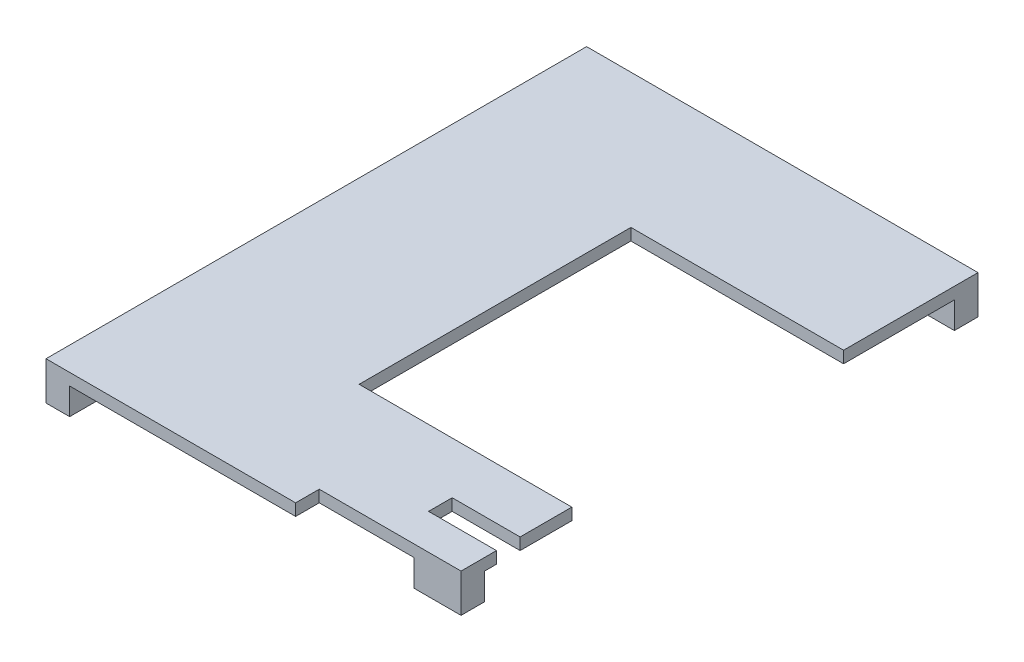
ISO-10303-21;
HEADER;
FILE_DESCRIPTION(('STEP AP214'),'2;1');
FILE_NAME('part.step','',(''),(''),'','','');
FILE_SCHEMA(('AUTOMOTIVE_DESIGN { 1 0 10303 214 1 1 1 1 }'));
ENDSEC;
DATA;
#1=APPLICATION_CONTEXT('core data for automotive mechanical design processes');
#2=APPLICATION_PROTOCOL_DEFINITION('international standard','automotive_design',2000,#1);
#3=PRODUCT_CONTEXT('',#1,'mechanical');
#4=PRODUCT('Part','Part','',(#3));
#5=PRODUCT_RELATED_PRODUCT_CATEGORY('part','',(#4));
#6=PRODUCT_DEFINITION_FORMATION('','',#4);
#7=PRODUCT_DEFINITION_CONTEXT('part definition',#1,'design');
#8=PRODUCT_DEFINITION('design','',#6,#7);
#9=PRODUCT_DEFINITION_SHAPE('','',#8);
#10=(LENGTH_UNIT() NAMED_UNIT(*) SI_UNIT(.MILLI.,.METRE.));
#11=(NAMED_UNIT(*) PLANE_ANGLE_UNIT() SI_UNIT($,.RADIAN.));
#12=(NAMED_UNIT(*) SI_UNIT($,.STERADIAN.) SOLID_ANGLE_UNIT());
#13=UNCERTAINTY_MEASURE_WITH_UNIT(LENGTH_MEASURE(1.E-05),#10,'distance_accuracy_value','');
#14=(GEOMETRIC_REPRESENTATION_CONTEXT(3) GLOBAL_UNCERTAINTY_ASSIGNED_CONTEXT((#13)) GLOBAL_UNIT_ASSIGNED_CONTEXT((#10,
#11,#12)) REPRESENTATION_CONTEXT('',''));
#15=CARTESIAN_POINT('',(0.,0.,0.));
#16=DIRECTION('',(0.,0.,1.));
#17=DIRECTION('',(1.,0.,0.));
#18=AXIS2_PLACEMENT_3D('',#15,#16,#17);
#19=CARTESIAN_POINT('',(0.,0.,0.));
#20=DIRECTION('',(1.,0.,0.));
#21=DIRECTION('',(0.,0.,-1.));
#22=AXIS2_PLACEMENT_3D('',#19,#20,#21);
#23=PLANE('',#22);
#24=DIRECTION('',(0.,0.,1.));
#25=VECTOR('',#24,1.);
#26=CARTESIAN_POINT('',(0.,6.35,0.));
#27=LINE('',#26,#25);
#28=CARTESIAN_POINT('',(0.,6.35,73.025));
#29=VERTEX_POINT('',#28);
#30=CARTESIAN_POINT('',(0.,6.35,100.80625));
#31=VERTEX_POINT('',#30);
#32=EDGE_CURVE('E175',#29,#31,#27,.T.);
#33=ORIENTED_EDGE('',*,*,#32,.T.);
#34=DIRECTION('',(0.,-1.,0.));
#35=VECTOR('',#34,1.);
#36=CARTESIAN_POINT('',(0.,0.,100.80625));
#37=LINE('',#36,#35);
#38=CARTESIAN_POINT('',(0.,0.,100.80625));
#39=VERTEX_POINT('',#38);
#40=EDGE_CURVE('E182',#31,#39,#37,.T.);
#41=ORIENTED_EDGE('',*,*,#40,.T.);
#42=DIRECTION('',(0.,0.,1.));
#43=VECTOR('',#42,1.);
#44=CARTESIAN_POINT('',(0.,0.,0.));
#45=LINE('',#44,#43);
#46=CARTESIAN_POINT('',(0.,0.,73.025));
#47=VERTEX_POINT('',#46);
#48=EDGE_CURVE('E167',#47,#39,#45,.T.);
#49=ORIENTED_EDGE('',*,*,#48,.F.);
#50=DIRECTION('',(0.,1.,0.));
#51=VECTOR('',#50,1.);
#52=CARTESIAN_POINT('',(0.,0.,73.025));
#53=LINE('',#52,#51);
#54=EDGE_CURVE('E185',#47,#29,#53,.T.);
#55=ORIENTED_EDGE('',*,*,#54,.T.);
#56=EDGE_LOOP('',(#33,#41,#49,#55));
#57=FACE_BOUND('',#56,.T.);
#58=ADVANCED_FACE('F33',(#57),#23,.T.);
#59=DIRECTION('',(0.,1.,0.));
#60=VECTOR('',#59,1.);
#61=CARTESIAN_POINT('',(0.,6.35,-145.25625));
#62=LINE('',#61,#60);
#63=CARTESIAN_POINT('',(0.,-14.2875,-145.25625));
#64=VERTEX_POINT('',#63);
#65=CARTESIAN_POINT('',(0.,6.35,-145.25625));
#66=VERTEX_POINT('',#65);
#67=EDGE_CURVE('E168',#64,#66,#62,.T.);
#68=ORIENTED_EDGE('',*,*,#67,.T.);
#69=CARTESIAN_POINT('',(0.,6.35,-73.025));
#70=VERTEX_POINT('',#69);
#71=EDGE_CURVE('E171',#66,#70,#27,.T.);
#72=ORIENTED_EDGE('',*,*,#71,.T.);
#73=DIRECTION('',(0.,-1.,0.));
#74=VECTOR('',#73,1.);
#75=CARTESIAN_POINT('',(0.,0.,-73.025));
#76=LINE('',#75,#74);
#77=CARTESIAN_POINT('',(0.,0.,-73.025));
#78=VERTEX_POINT('',#77);
#79=EDGE_CURVE('E188',#70,#78,#76,.T.);
#80=ORIENTED_EDGE('',*,*,#79,.T.);
#81=CARTESIAN_POINT('',(0.,0.,-132.55625));
#82=VERTEX_POINT('',#81);
#83=EDGE_CURVE('E164',#82,#78,#45,.T.);
#84=ORIENTED_EDGE('',*,*,#83,.F.);
#85=DIRECTION('',(0.,-1.,0.));
#86=VECTOR('',#85,1.);
#87=CARTESIAN_POINT('',(0.,-14.2875,-132.55625));
#88=LINE('',#87,#86);
#89=CARTESIAN_POINT('',(0.,-14.2875,-132.55625));
#90=VERTEX_POINT('',#89);
#91=EDGE_CURVE('E191',#82,#90,#88,.T.);
#92=ORIENTED_EDGE('',*,*,#91,.T.);
#93=DIRECTION('',(0.,0.,-1.));
#94=VECTOR('',#93,1.);
#95=CARTESIAN_POINT('',(0.,-14.2875,0.));
#96=LINE('',#95,#94);
#97=EDGE_CURVE('E194',#90,#64,#96,.T.);
#98=ORIENTED_EDGE('',*,*,#97,.T.);
#99=EDGE_LOOP('',(#68,#72,#80,#84,#92,#98));
#100=FACE_BOUND('',#99,.T.);
#101=ADVANCED_FACE('F462',(#100),#23,.T.);
#102=CARTESIAN_POINT('',(0.,0.,113.50625));
#103=VERTEX_POINT('',#102);
#104=CARTESIAN_POINT('',(0.,0.,119.85625));
#105=VERTEX_POINT('',#104);
#106=EDGE_CURVE('E163',#103,#105,#45,.T.);
#107=ORIENTED_EDGE('',*,*,#106,.F.);
#108=DIRECTION('',(0.,1.,0.));
#109=VECTOR('',#108,1.);
#110=CARTESIAN_POINT('',(0.,0.,113.50625));
#111=LINE('',#110,#109);
#112=CARTESIAN_POINT('',(0.,6.35,113.50625));
#113=VERTEX_POINT('',#112);
#114=EDGE_CURVE('E179',#103,#113,#111,.T.);
#115=ORIENTED_EDGE('',*,*,#114,.T.);
#116=CARTESIAN_POINT('',(0.,6.35,132.55625));
#117=VERTEX_POINT('',#116);
#118=EDGE_CURVE('E172',#113,#117,#27,.T.);
#119=ORIENTED_EDGE('',*,*,#118,.T.);
#120=DIRECTION('',(0.,-1.,0.));
#121=VECTOR('',#120,1.);
#122=CARTESIAN_POINT('',(0.,0.,132.55625));
#123=LINE('',#122,#121);
#124=CARTESIAN_POINT('',(0.,-14.2875,132.55625));
#125=VERTEX_POINT('',#124);
#126=EDGE_CURVE('E176',#117,#125,#123,.T.);
#127=ORIENTED_EDGE('',*,*,#126,.T.);
#128=DIRECTION('',(0.,0.,1.));
#129=VECTOR('',#128,1.);
#130=CARTESIAN_POINT('',(0.,-14.2875,0.));
#131=LINE('',#130,#129);
#132=CARTESIAN_POINT('',(0.,-14.2875,119.85625));
#133=VERTEX_POINT('',#132);
#134=EDGE_CURVE('E124',#133,#125,#131,.T.);
#135=ORIENTED_EDGE('',*,*,#134,.F.);
#136=DIRECTION('',(0.,1.,0.));
#137=VECTOR('',#136,1.);
#138=CARTESIAN_POINT('',(0.,-14.2875,119.85625));
#139=LINE('',#138,#137);
#140=EDGE_CURVE('E197',#133,#105,#139,.T.);
#141=ORIENTED_EDGE('',*,*,#140,.T.);
#142=EDGE_LOOP('',(#107,#115,#119,#127,#135,#141));
#143=FACE_BOUND('',#142,.T.);
#144=ADVANCED_FACE('F272',(#143),#23,.T.);
#145=CARTESIAN_POINT('',(0.,-14.2875,0.));
#146=DIRECTION('',(0.,-1.,0.));
#147=DIRECTION('',(0.,0.,-1.));
#148=AXIS2_PLACEMENT_3D('',#145,#146,#147);
#149=PLANE('',#148);
#150=DIRECTION('',(0.,0.,-1.));
#151=VECTOR('',#150,1.);
#152=CARTESIAN_POINT('',(-210.34375,-14.2875,94.45625));
#153=LINE('',#152,#151);
#154=CARTESIAN_POINT('',(-210.34375,-14.2875,145.25625));
#155=VERTEX_POINT('',#154);
#156=CARTESIAN_POINT('',(-210.34375,-14.2875,94.45625));
#157=VERTEX_POINT('',#156);
#158=EDGE_CURVE('E375',#155,#157,#153,.T.);
#159=ORIENTED_EDGE('',*,*,#158,.T.);
#160=DIRECTION('',(1.,0.,0.));
#161=VECTOR('',#160,1.);
#162=CARTESIAN_POINT('',(-197.64375,-14.2875,94.45625));
#163=LINE('',#162,#161);
#164=CARTESIAN_POINT('',(-197.64375,-14.2875,94.45625));
#165=VERTEX_POINT('',#164);
#166=EDGE_CURVE('E366',#157,#165,#163,.T.);
#167=ORIENTED_EDGE('',*,*,#166,.T.);
#168=DIRECTION('',(0.,0.,1.));
#169=VECTOR('',#168,1.);
#170=CARTESIAN_POINT('',(-197.64375,-14.2875,94.45625));
#171=LINE('',#170,#169);
#172=CARTESIAN_POINT('',(-197.64375,-14.2875,145.25625));
#173=VERTEX_POINT('',#172);
#174=EDGE_CURVE('E376',#165,#173,#171,.T.);
#175=ORIENTED_EDGE('',*,*,#174,.T.);
#176=DIRECTION('',(-1.,0.,0.));
#177=VECTOR('',#176,1.);
#178=CARTESIAN_POINT('',(-197.64375,-14.2875,145.25625));
#179=LINE('',#178,#177);
#180=EDGE_CURVE('E382',#173,#155,#179,.T.);
#181=ORIENTED_EDGE('',*,*,#180,.T.);
#182=EDGE_LOOP('',(#159,#167,#175,#181));
#183=FACE_BOUND('',#182,.T.);
#184=ADVANCED_FACE('F380',(#183),#149,.T.);
#185=CARTESIAN_POINT('',(-197.64375,-14.2875,-94.45625));
#186=DIRECTION('',(0.,0.,-1.));
#187=DIRECTION('',(-1.,0.,0.));
#188=AXIS2_PLACEMENT_3D('',#185,#186,#187);
#189=PLANE('',#188);
#190=DIRECTION('',(-1.,0.,0.));
#191=VECTOR('',#190,1.);
#192=CARTESIAN_POINT('',(-197.64375,0.,-94.45625));
#193=LINE('',#192,#191);
#194=CARTESIAN_POINT('',(-197.64375,0.,-94.45625));
#195=VERTEX_POINT('',#194);
#196=CARTESIAN_POINT('',(-210.34375,0.,-94.45625));
#197=VERTEX_POINT('',#196);
#198=EDGE_CURVE('E136',#195,#197,#193,.T.);
#199=ORIENTED_EDGE('',*,*,#198,.T.);
#200=DIRECTION('',(0.,1.,0.));
#201=VECTOR('',#200,1.);
#202=CARTESIAN_POINT('',(-210.34375,-14.2875,-94.45625));
#203=LINE('',#202,#201);
#204=CARTESIAN_POINT('',(-210.34375,-14.2875,-94.45625));
#205=VERTEX_POINT('',#204);
#206=EDGE_CURVE('E405',#205,#197,#203,.T.);
#207=ORIENTED_EDGE('',*,*,#206,.F.);
#208=DIRECTION('',(-1.,0.,0.));
#209=VECTOR('',#208,1.);
#210=CARTESIAN_POINT('',(-197.64375,-14.2875,-94.45625));
#211=LINE('',#210,#209);
#212=CARTESIAN_POINT('',(-197.64375,-14.2875,-94.45625));
#213=VERTEX_POINT('',#212);
#214=EDGE_CURVE('E134',#213,#205,#211,.T.);
#215=ORIENTED_EDGE('',*,*,#214,.F.);
#216=DIRECTION('',(0.,1.,0.));
#217=VECTOR('',#216,1.);
#218=CARTESIAN_POINT('',(-197.64375,-14.2875,-94.45625));
#219=LINE('',#218,#217);
#220=EDGE_CURVE('E402',#213,#195,#219,.T.);
#221=ORIENTED_EDGE('',*,*,#220,.T.);
#222=EDGE_LOOP('',(#199,#207,#215,#221));
#223=FACE_BOUND('',#222,.T.);
#224=ADVANCED_FACE('F414',(#223),#189,.F.);
#225=CARTESIAN_POINT('',(-197.64375,-14.2875,94.45625));
#226=DIRECTION('',(0.,0.,1.));
#227=DIRECTION('',(1.,0.,0.));
#228=AXIS2_PLACEMENT_3D('',#225,#226,#227);
#229=PLANE('',#228);
#230=DIRECTION('',(1.,0.,0.));
#231=VECTOR('',#230,1.);
#232=CARTESIAN_POINT('',(-197.64375,0.,94.45625));
#233=LINE('',#232,#231);
#234=CARTESIAN_POINT('',(-210.34375,0.,94.45625));
#235=VERTEX_POINT('',#234);
#236=CARTESIAN_POINT('',(-197.64375,0.,94.45625));
#237=VERTEX_POINT('',#236);
#238=EDGE_CURVE('E397',#235,#237,#233,.T.);
#239=ORIENTED_EDGE('',*,*,#238,.T.);
#240=DIRECTION('',(0.,1.,0.));
#241=VECTOR('',#240,1.);
#242=CARTESIAN_POINT('',(-197.64375,-14.2875,94.45625));
#243=LINE('',#242,#241);
#244=EDGE_CURVE('E372',#165,#237,#243,.T.);
#245=ORIENTED_EDGE('',*,*,#244,.F.);
#246=ORIENTED_EDGE('',*,*,#166,.F.);
#247=DIRECTION('',(0.,1.,0.));
#248=VECTOR('',#247,1.);
#249=CARTESIAN_POINT('',(-210.34375,-14.2875,94.45625));
#250=LINE('',#249,#248);
#251=EDGE_CURVE('E250',#157,#235,#250,.T.);
#252=ORIENTED_EDGE('',*,*,#251,.T.);
#253=EDGE_LOOP('',(#239,#245,#246,#252));
#254=FACE_BOUND('',#253,.T.);
#255=ADVANCED_FACE('F369',(#254),#229,.F.);
#256=CARTESIAN_POINT('',(-197.64375,-14.2875,94.45625));
#257=DIRECTION('',(-1.,0.,0.));
#258=DIRECTION('',(0.,0.,1.));
#259=AXIS2_PLACEMENT_3D('',#256,#257,#258);
#260=PLANE('',#259);
#261=DIRECTION('',(0.,0.,1.));
#262=VECTOR('',#261,1.);
#263=CARTESIAN_POINT('',(-197.64375,0.,94.45625));
#264=LINE('',#263,#262);
#265=CARTESIAN_POINT('',(-197.64375,0.,145.25625));
#266=VERTEX_POINT('',#265);
#267=EDGE_CURVE('E383',#237,#266,#264,.T.);
#268=ORIENTED_EDGE('',*,*,#267,.T.);
#269=DIRECTION('',(0.,1.,0.));
#270=VECTOR('',#269,1.);
#271=CARTESIAN_POINT('',(-197.64375,-14.2875,145.25625));
#272=LINE('',#271,#270);
#273=EDGE_CURVE('E388',#173,#266,#272,.T.);
#274=ORIENTED_EDGE('',*,*,#273,.F.);
#275=ORIENTED_EDGE('',*,*,#174,.F.);
#276=ORIENTED_EDGE('',*,*,#244,.T.);
#277=EDGE_LOOP('',(#268,#274,#275,#276));
#278=FACE_BOUND('',#277,.T.);
#279=ADVANCED_FACE('F489',(#278),#260,.F.);
#280=CARTESIAN_POINT('',(0.,-14.2875,0.));
#281=DIRECTION('',(0.,1.,0.));
#282=DIRECTION('',(0.,0.,1.));
#283=AXIS2_PLACEMENT_3D('',#280,#281,#282);
#284=PLANE('',#283);
#285=DIRECTION('',(0.,0.,-1.));
#286=VECTOR('',#285,1.);
#287=CARTESIAN_POINT('',(-210.34375,-14.2875,-94.45625));
#288=LINE('',#287,#286);
#289=CARTESIAN_POINT('',(-210.34375,-14.2875,-145.25625));
#290=VERTEX_POINT('',#289);
#291=EDGE_CURVE('E117',#205,#290,#288,.T.);
#292=ORIENTED_EDGE('',*,*,#291,.T.);
#293=DIRECTION('',(1.,0.,0.));
#294=VECTOR('',#293,1.);
#295=CARTESIAN_POINT('',(-197.64375,-14.2875,-145.25625));
#296=LINE('',#295,#294);
#297=CARTESIAN_POINT('',(-197.64375,-14.2875,-145.25625));
#298=VERTEX_POINT('',#297);
#299=EDGE_CURVE('E108',#290,#298,#296,.T.);
#300=ORIENTED_EDGE('',*,*,#299,.T.);
#301=DIRECTION('',(0.,0.,1.));
#302=VECTOR('',#301,1.);
#303=CARTESIAN_POINT('',(-197.64375,-14.2875,-94.45625));
#304=LINE('',#303,#302);
#305=EDGE_CURVE('E130',#298,#213,#304,.T.);
#306=ORIENTED_EDGE('',*,*,#305,.T.);
#307=ORIENTED_EDGE('',*,*,#214,.T.);
#308=EDGE_LOOP('',(#292,#300,#306,#307));
#309=FACE_BOUND('',#308,.T.);
#310=ADVANCED_FACE('F132',(#309),#284,.F.);
#311=CARTESIAN_POINT('',(-197.64375,-14.2875,-94.45625));
#312=DIRECTION('',(-1.,0.,0.));
#313=DIRECTION('',(0.,0.,1.));
#314=AXIS2_PLACEMENT_3D('',#311,#312,#313);
#315=PLANE('',#314);
#316=DIRECTION('',(0.,0.,1.));
#317=VECTOR('',#316,1.);
#318=CARTESIAN_POINT('',(-197.64375,0.,-94.45625));
#319=LINE('',#318,#317);
#320=CARTESIAN_POINT('',(-197.64375,0.,-145.25625));
#321=VERTEX_POINT('',#320);
#322=EDGE_CURVE('E139',#321,#195,#319,.T.);
#323=ORIENTED_EDGE('',*,*,#322,.T.);
#324=ORIENTED_EDGE('',*,*,#220,.F.);
#325=ORIENTED_EDGE('',*,*,#305,.F.);
#326=DIRECTION('',(0.,1.,0.));
#327=VECTOR('',#326,1.);
#328=CARTESIAN_POINT('',(-197.64375,-14.2875,-145.25625));
#329=LINE('',#328,#327);
#330=EDGE_CURVE('E128',#298,#321,#329,.T.);
#331=ORIENTED_EDGE('',*,*,#330,.T.);
#332=EDGE_LOOP('',(#323,#324,#325,#331));
#333=FACE_BOUND('',#332,.T.);
#334=ADVANCED_FACE('F410',(#333),#315,.F.);
#335=CARTESIAN_POINT('',(-210.34375,6.35,145.25625));
#336=DIRECTION('',(0.,0.,-1.));
#337=DIRECTION('',(-1.,0.,0.));
#338=AXIS2_PLACEMENT_3D('',#335,#336,#337);
#339=PLANE('',#338);
#340=DIRECTION('',(0.,-1.,0.));
#341=VECTOR('',#340,1.);
#342=CARTESIAN_POINT('',(-210.34375,6.35,145.25625));
#343=LINE('',#342,#341);
#344=CARTESIAN_POINT('',(-210.34375,6.35,145.25625));
#345=VERTEX_POINT('',#344);
#346=EDGE_CURVE('E123',#345,#155,#343,.T.);
#347=ORIENTED_EDGE('',*,*,#346,.T.);
#348=ORIENTED_EDGE('',*,*,#180,.F.);
#349=ORIENTED_EDGE('',*,*,#273,.T.);
#350=DIRECTION('',(1.,0.,0.));
#351=VECTOR('',#350,1.);
#352=CARTESIAN_POINT('',(-210.34375,0.,145.25625));
#353=LINE('',#352,#351);
#354=CARTESIAN_POINT('',(-76.2,0.,145.25625));
#355=VERTEX_POINT('',#354);
#356=EDGE_CURVE('E206',#266,#355,#353,.T.);
#357=ORIENTED_EDGE('',*,*,#356,.T.);
#358=DIRECTION('',(0.,1.,0.));
#359=VECTOR('',#358,1.);
#360=CARTESIAN_POINT('',(-76.2,0.,145.25625));
#361=LINE('',#360,#359);
#362=CARTESIAN_POINT('',(-76.2,6.35,145.25625));
#363=VERTEX_POINT('',#362);
#364=EDGE_CURVE('E243',#355,#363,#361,.T.);
#365=ORIENTED_EDGE('',*,*,#364,.T.);
#366=DIRECTION('',(1.,0.,0.));
#367=VECTOR('',#366,1.);
#368=CARTESIAN_POINT('',(-210.34375,6.35,145.25625));
#369=LINE('',#368,#367);
#370=EDGE_CURVE('E200',#345,#363,#369,.T.);
#371=ORIENTED_EDGE('',*,*,#370,.F.);
#372=EDGE_LOOP('',(#347,#348,#349,#357,#365,#371));
#373=FACE_BOUND('',#372,.T.);
#374=ADVANCED_FACE('F486',(#373),#339,.F.);
#375=CARTESIAN_POINT('',(-210.34375,6.35,145.25625));
#376=DIRECTION('',(1.,0.,0.));
#377=DIRECTION('',(0.,0.,-1.));
#378=AXIS2_PLACEMENT_3D('',#375,#376,#377);
#379=PLANE('',#378);
#380=DIRECTION('',(0.,-1.,0.));
#381=VECTOR('',#380,1.);
#382=CARTESIAN_POINT('',(-210.34375,6.35,-145.25625));
#383=LINE('',#382,#381);
#384=CARTESIAN_POINT('',(-210.34375,6.35,-145.25625));
#385=VERTEX_POINT('',#384);
#386=EDGE_CURVE('E114',#385,#290,#383,.T.);
#387=ORIENTED_EDGE('',*,*,#386,.T.);
#388=ORIENTED_EDGE('',*,*,#291,.F.);
#389=ORIENTED_EDGE('',*,*,#206,.T.);
#390=DIRECTION('',(0.,0.,1.));
#391=VECTOR('',#390,1.);
#392=CARTESIAN_POINT('',(-210.34375,0.,145.25625));
#393=LINE('',#392,#391);
#394=EDGE_CURVE('E209',#197,#235,#393,.T.);
#395=ORIENTED_EDGE('',*,*,#394,.T.);
#396=ORIENTED_EDGE('',*,*,#251,.F.);
#397=ORIENTED_EDGE('',*,*,#158,.F.);
#398=ORIENTED_EDGE('',*,*,#346,.F.);
#399=DIRECTION('',(0.,0.,1.));
#400=VECTOR('',#399,1.);
#401=CARTESIAN_POINT('',(-210.34375,6.35,145.25625));
#402=LINE('',#401,#400);
#403=EDGE_CURVE('E121',#385,#345,#402,.T.);
#404=ORIENTED_EDGE('',*,*,#403,.F.);
#405=EDGE_LOOP('',(#387,#388,#389,#395,#396,#397,#398,#404));
#406=FACE_BOUND('',#405,.T.);
#407=ADVANCED_FACE('F115',(#406),#379,.F.);
#408=CARTESIAN_POINT('',(-76.2,0.,132.55625));
#409=DIRECTION('',(-1.,0.,0.));
#410=DIRECTION('',(0.,0.,1.));
#411=AXIS2_PLACEMENT_3D('',#408,#409,#410);
#412=PLANE('',#411);
#413=DIRECTION('',(0.,0.,1.));
#414=VECTOR('',#413,1.);
#415=CARTESIAN_POINT('',(-76.2,6.35,132.55625));
#416=LINE('',#415,#414);
#417=CARTESIAN_POINT('',(-76.2,6.35,132.55625));
#418=VERTEX_POINT('',#417);
#419=EDGE_CURVE('E245',#418,#363,#416,.T.);
#420=ORIENTED_EDGE('',*,*,#419,.T.);
#421=ORIENTED_EDGE('',*,*,#364,.F.);
#422=DIRECTION('',(0.,0.,1.));
#423=VECTOR('',#422,1.);
#424=CARTESIAN_POINT('',(-76.2,0.,132.55625));
#425=LINE('',#424,#423);
#426=CARTESIAN_POINT('',(-76.2,0.,132.55625));
#427=VERTEX_POINT('',#426);
#428=EDGE_CURVE('E246',#427,#355,#425,.T.);
#429=ORIENTED_EDGE('',*,*,#428,.F.);
#430=DIRECTION('',(0.,1.,0.));
#431=VECTOR('',#430,1.);
#432=CARTESIAN_POINT('',(-76.2,0.,132.55625));
#433=LINE('',#432,#431);
#434=EDGE_CURVE('E421',#427,#418,#433,.T.);
#435=ORIENTED_EDGE('',*,*,#434,.T.);
#436=EDGE_LOOP('',(#420,#421,#429,#435));
#437=FACE_BOUND('',#436,.T.);
#438=ADVANCED_FACE('F482',(#437),#412,.F.);
#439=CARTESIAN_POINT('',(-36.5125,0.,113.50625));
#440=DIRECTION('',(-1.,0.,0.));
#441=DIRECTION('',(0.,0.,1.));
#442=AXIS2_PLACEMENT_3D('',#439,#440,#441);
#443=PLANE('',#442);
#444=DIRECTION('',(0.,0.,1.));
#445=VECTOR('',#444,1.);
#446=CARTESIAN_POINT('',(-36.5125,6.35,113.50625));
#447=LINE('',#446,#445);
#448=CARTESIAN_POINT('',(-36.5125,6.35,100.80625));
#449=VERTEX_POINT('',#448);
#450=CARTESIAN_POINT('',(-36.5125,6.35,113.50625));
#451=VERTEX_POINT('',#450);
#452=EDGE_CURVE('E239',#449,#451,#447,.T.);
#453=ORIENTED_EDGE('',*,*,#452,.T.);
#454=DIRECTION('',(0.,1.,0.));
#455=VECTOR('',#454,1.);
#456=CARTESIAN_POINT('',(-36.5125,0.,113.50625));
#457=LINE('',#456,#455);
#458=CARTESIAN_POINT('',(-36.5125,0.,113.50625));
#459=VERTEX_POINT('',#458);
#460=EDGE_CURVE('E227',#459,#451,#457,.T.);
#461=ORIENTED_EDGE('',*,*,#460,.F.);
#462=DIRECTION('',(0.,0.,1.));
#463=VECTOR('',#462,1.);
#464=CARTESIAN_POINT('',(-36.5125,0.,113.50625));
#465=LINE('',#464,#463);
#466=CARTESIAN_POINT('',(-36.5125,0.,100.80625));
#467=VERTEX_POINT('',#466);
#468=EDGE_CURVE('E231',#467,#459,#465,.T.);
#469=ORIENTED_EDGE('',*,*,#468,.F.);
#470=DIRECTION('',(0.,1.,0.));
#471=VECTOR('',#470,1.);
#472=CARTESIAN_POINT('',(-36.5125,0.,100.80625));
#473=LINE('',#472,#471);
#474=EDGE_CURVE('E232',#467,#449,#473,.T.);
#475=ORIENTED_EDGE('',*,*,#474,.T.);
#476=EDGE_LOOP('',(#453,#461,#469,#475));
#477=FACE_BOUND('',#476,.T.);
#478=ADVANCED_FACE('F519',(#477),#443,.F.);
#479=CARTESIAN_POINT('',(0.,0.,0.));
#480=DIRECTION('',(0.,-1.,0.));
#481=DIRECTION('',(0.,0.,-1.));
#482=AXIS2_PLACEMENT_3D('',#479,#480,#481);
#483=PLANE('',#482);
#484=DIRECTION('',(-1.,0.,0.));
#485=VECTOR('',#484,1.);
#486=CARTESIAN_POINT('',(25.4,0.,-132.55625));
#487=LINE('',#486,#485);
#488=CARTESIAN_POINT('',(-25.4,0.,-132.55625));
#489=VERTEX_POINT('',#488);
#490=EDGE_CURVE('E70',#82,#489,#487,.T.);
#491=ORIENTED_EDGE('',*,*,#490,.F.);
#492=ORIENTED_EDGE('',*,*,#83,.T.);
#493=DIRECTION('',(-1.,0.,0.));
#494=VECTOR('',#493,1.);
#495=CARTESIAN_POINT('',(-114.3,0.,-73.025));
#496=LINE('',#495,#494);
#497=CARTESIAN_POINT('',(-114.3,0.,-73.025));
#498=VERTEX_POINT('',#497);
#499=EDGE_CURVE('E217',#78,#498,#496,.T.);
#500=ORIENTED_EDGE('',*,*,#499,.T.);
#501=DIRECTION('',(0.,0.,1.));
#502=VECTOR('',#501,1.);
#503=CARTESIAN_POINT('',(-114.3,0.,73.025));
#504=LINE('',#503,#502);
#505=CARTESIAN_POINT('',(-114.3,0.,73.025));
#506=VERTEX_POINT('',#505);
#507=EDGE_CURVE('E215',#498,#506,#504,.T.);
#508=ORIENTED_EDGE('',*,*,#507,.T.);
#509=DIRECTION('',(1.,0.,0.));
#510=VECTOR('',#509,1.);
#511=CARTESIAN_POINT('',(-114.3,0.,73.025));
#512=LINE('',#511,#510);
#513=EDGE_CURVE('E212',#506,#47,#512,.T.);
#514=ORIENTED_EDGE('',*,*,#513,.T.);
#515=ORIENTED_EDGE('',*,*,#48,.T.);
#516=DIRECTION('',(-1.,0.,0.));
#517=VECTOR('',#516,1.);
#518=CARTESIAN_POINT('',(-36.5125,0.,100.80625));
#519=LINE('',#518,#517);
#520=EDGE_CURVE('E233',#39,#467,#519,.T.);
#521=ORIENTED_EDGE('',*,*,#520,.T.);
#522=ORIENTED_EDGE('',*,*,#468,.T.);
#523=DIRECTION('',(1.,0.,0.));
#524=VECTOR('',#523,1.);
#525=CARTESIAN_POINT('',(-36.5125,0.,113.50625));
#526=LINE('',#525,#524);
#527=EDGE_CURVE('E228',#459,#103,#526,.T.);
#528=ORIENTED_EDGE('',*,*,#527,.T.);
#529=ORIENTED_EDGE('',*,*,#106,.T.);
#530=DIRECTION('',(1.,0.,0.));
#531=VECTOR('',#530,1.);
#532=CARTESIAN_POINT('',(25.4,0.,119.85625));
#533=LINE('',#532,#531);
#534=CARTESIAN_POINT('',(-25.4,0.,119.85625));
#535=VERTEX_POINT('',#534);
#536=EDGE_CURVE('E37',#535,#105,#533,.T.);
#537=ORIENTED_EDGE('',*,*,#536,.F.);
#538=DIRECTION('',(0.,0.,-1.));
#539=VECTOR('',#538,1.);
#540=CARTESIAN_POINT('',(-25.4,0.,119.85625));
#541=LINE('',#540,#539);
#542=CARTESIAN_POINT('',(-25.4,0.,132.55625));
#543=VERTEX_POINT('',#542);
#544=EDGE_CURVE('E11',#543,#535,#541,.T.);
#545=ORIENTED_EDGE('',*,*,#544,.F.);
#546=DIRECTION('',(-1.,0.,0.));
#547=VECTOR('',#546,1.);
#548=CARTESIAN_POINT('',(-76.2,0.,132.55625));
#549=LINE('',#548,#547);
#550=EDGE_CURVE('E50',#543,#427,#549,.T.);
#551=ORIENTED_EDGE('',*,*,#550,.T.);
#552=ORIENTED_EDGE('',*,*,#428,.T.);
#553=ORIENTED_EDGE('',*,*,#356,.F.);
#554=ORIENTED_EDGE('',*,*,#267,.F.);
#555=ORIENTED_EDGE('',*,*,#238,.F.);
#556=ORIENTED_EDGE('',*,*,#394,.F.);
#557=ORIENTED_EDGE('',*,*,#198,.F.);
#558=ORIENTED_EDGE('',*,*,#322,.F.);
#559=DIRECTION('',(-1.,0.,0.));
#560=VECTOR('',#559,1.);
#561=CARTESIAN_POINT('',(-210.34375,0.,-145.25625));
#562=LINE('',#561,#560);
#563=CARTESIAN_POINT('',(-25.4,0.,-145.25625));
#564=VERTEX_POINT('',#563);
#565=EDGE_CURVE('E91',#564,#321,#562,.T.);
#566=ORIENTED_EDGE('',*,*,#565,.F.);
#567=DIRECTION('',(0.,0.,-1.));
#568=VECTOR('',#567,1.);
#569=CARTESIAN_POINT('',(-25.4,0.,-132.55625));
#570=LINE('',#569,#568);
#571=EDGE_CURVE('E147',#489,#564,#570,.T.);
#572=ORIENTED_EDGE('',*,*,#571,.F.);
#573=EDGE_LOOP('',(#491,#492,#500,#508,#514,#515,#521,#522,#528,#529,#537,#545,#551,#552,#553,
#554,#555,#556,#557,#558,#566,#572));
#574=FACE_BOUND('',#573,.T.);
#575=ADVANCED_FACE('F416',(#574),#483,.T.);
#576=CARTESIAN_POINT('',(-25.4,-14.2875,119.85625));
#577=DIRECTION('',(1.,0.,0.));
#578=DIRECTION('',(0.,0.,-1.));
#579=AXIS2_PLACEMENT_3D('',#576,#577,#578);
#580=PLANE('',#579);
#581=ORIENTED_EDGE('',*,*,#544,.T.);
#582=DIRECTION('',(0.,1.,0.));
#583=VECTOR('',#582,1.);
#584=CARTESIAN_POINT('',(-25.4,-14.2875,119.85625));
#585=LINE('',#584,#583);
#586=CARTESIAN_POINT('',(-25.4,-14.2875,119.85625));
#587=VERTEX_POINT('',#586);
#588=EDGE_CURVE('E150',#587,#535,#585,.T.);
#589=ORIENTED_EDGE('',*,*,#588,.F.);
#590=DIRECTION('',(0.,0.,-1.));
#591=VECTOR('',#590,1.);
#592=CARTESIAN_POINT('',(-25.4,-14.2875,119.85625));
#593=LINE('',#592,#591);
#594=CARTESIAN_POINT('',(-25.4,-14.2875,132.55625));
#595=VERTEX_POINT('',#594);
#596=EDGE_CURVE('E159',#595,#587,#593,.T.);
#597=ORIENTED_EDGE('',*,*,#596,.F.);
#598=DIRECTION('',(0.,1.,0.));
#599=VECTOR('',#598,1.);
#600=CARTESIAN_POINT('',(-25.4,-14.2875,132.55625));
#601=LINE('',#600,#599);
#602=EDGE_CURVE('E156',#595,#543,#601,.T.);
#603=ORIENTED_EDGE('',*,*,#602,.T.);
#604=EDGE_LOOP('',(#581,#589,#597,#603));
#605=FACE_BOUND('',#604,.T.);
#606=ADVANCED_FACE('F478',(#605),#580,.F.);
#607=CARTESIAN_POINT('',(-76.2,0.,132.55625));
#608=DIRECTION('',(0.,0.,-1.));
#609=DIRECTION('',(-1.,0.,0.));
#610=AXIS2_PLACEMENT_3D('',#607,#608,#609);
#611=PLANE('',#610);
#612=ORIENTED_EDGE('',*,*,#126,.F.);
#613=DIRECTION('',(-1.,0.,0.));
#614=VECTOR('',#613,1.);
#615=CARTESIAN_POINT('',(-76.2,6.35,132.55625));
#616=LINE('',#615,#614);
#617=EDGE_CURVE('E247',#117,#418,#616,.T.);
#618=ORIENTED_EDGE('',*,*,#617,.T.);
#619=ORIENTED_EDGE('',*,*,#434,.F.);
#620=ORIENTED_EDGE('',*,*,#550,.F.);
#621=ORIENTED_EDGE('',*,*,#602,.F.);
#622=DIRECTION('',(-1.,0.,0.));
#623=VECTOR('',#622,1.);
#624=CARTESIAN_POINT('',(25.4,-14.2875,132.55625));
#625=LINE('',#624,#623);
#626=EDGE_CURVE('E63',#125,#595,#625,.T.);
#627=ORIENTED_EDGE('',*,*,#626,.F.);
#628=EDGE_LOOP('',(#612,#618,#619,#620,#621,#627));
#629=FACE_BOUND('',#628,.T.);
#630=ADVANCED_FACE('F476',(#629),#611,.F.);
#631=CARTESIAN_POINT('',(25.4,-14.2875,119.85625));
#632=DIRECTION('',(0.,0.,1.));
#633=DIRECTION('',(1.,0.,0.));
#634=AXIS2_PLACEMENT_3D('',#631,#632,#633);
#635=PLANE('',#634);
#636=ORIENTED_EDGE('',*,*,#140,.F.);
#637=DIRECTION('',(1.,0.,0.));
#638=VECTOR('',#637,1.);
#639=CARTESIAN_POINT('',(25.4,-14.2875,119.85625));
#640=LINE('',#639,#638);
#641=EDGE_CURVE('E161',#587,#133,#640,.T.);
#642=ORIENTED_EDGE('',*,*,#641,.F.);
#643=ORIENTED_EDGE('',*,*,#588,.T.);
#644=ORIENTED_EDGE('',*,*,#536,.T.);
#645=EDGE_LOOP('',(#636,#642,#643,#644));
#646=FACE_BOUND('',#645,.T.);
#647=ADVANCED_FACE('F265',(#646),#635,.F.);
#648=CARTESIAN_POINT('',(0.,-14.2875,0.));
#649=DIRECTION('',(0.,-1.,0.));
#650=DIRECTION('',(0.,0.,-1.));
#651=AXIS2_PLACEMENT_3D('',#648,#649,#650);
#652=PLANE('',#651);
#653=ORIENTED_EDGE('',*,*,#641,.T.);
#654=ORIENTED_EDGE('',*,*,#134,.T.);
#655=ORIENTED_EDGE('',*,*,#626,.T.);
#656=ORIENTED_EDGE('',*,*,#596,.T.);
#657=EDGE_LOOP('',(#653,#654,#655,#656));
#658=FACE_BOUND('',#657,.T.);
#659=ADVANCED_FACE('F35',(#658),#652,.T.);
#660=CARTESIAN_POINT('',(-210.34375,6.35,-145.25625));
#661=DIRECTION('',(0.,0.,1.));
#662=DIRECTION('',(1.,0.,0.));
#663=AXIS2_PLACEMENT_3D('',#660,#661,#662);
#664=PLANE('',#663);
#665=ORIENTED_EDGE('',*,*,#67,.F.);
#666=DIRECTION('',(1.,0.,0.));
#667=VECTOR('',#666,1.);
#668=CARTESIAN_POINT('',(25.4,-14.2875,-145.25625));
#669=LINE('',#668,#667);
#670=CARTESIAN_POINT('',(-25.4,-14.2875,-145.25625));
#671=VERTEX_POINT('',#670);
#672=EDGE_CURVE('E153',#671,#64,#669,.T.);
#673=ORIENTED_EDGE('',*,*,#672,.F.);
#674=DIRECTION('',(0.,1.,0.));
#675=VECTOR('',#674,1.);
#676=CARTESIAN_POINT('',(-25.4,-14.2875,-145.25625));
#677=LINE('',#676,#675);
#678=EDGE_CURVE('E143',#671,#564,#677,.T.);
#679=ORIENTED_EDGE('',*,*,#678,.T.);
#680=ORIENTED_EDGE('',*,*,#565,.T.);
#681=ORIENTED_EDGE('',*,*,#330,.F.);
#682=ORIENTED_EDGE('',*,*,#299,.F.);
#683=ORIENTED_EDGE('',*,*,#386,.F.);
#684=DIRECTION('',(-1.,0.,0.));
#685=VECTOR('',#684,1.);
#686=CARTESIAN_POINT('',(-210.34375,6.35,-145.25625));
#687=LINE('',#686,#685);
#688=EDGE_CURVE('E203',#66,#385,#687,.T.);
#689=ORIENTED_EDGE('',*,*,#688,.F.);
#690=EDGE_LOOP('',(#665,#673,#679,#680,#681,#682,#683,#689));
#691=FACE_BOUND('',#690,.T.);
#692=ADVANCED_FACE('F127',(#691),#664,.F.);
#693=CARTESIAN_POINT('',(-25.4,-14.2875,-132.55625));
#694=DIRECTION('',(1.,0.,0.));
#695=DIRECTION('',(0.,0.,-1.));
#696=AXIS2_PLACEMENT_3D('',#693,#694,#695);
#697=PLANE('',#696);
#698=ORIENTED_EDGE('',*,*,#571,.T.);
#699=ORIENTED_EDGE('',*,*,#678,.F.);
#700=DIRECTION('',(0.,0.,-1.));
#701=VECTOR('',#700,1.);
#702=CARTESIAN_POINT('',(-25.4,-14.2875,-132.55625));
#703=LINE('',#702,#701);
#704=CARTESIAN_POINT('',(-25.4,-14.2875,-132.55625));
#705=VERTEX_POINT('',#704);
#706=EDGE_CURVE('E151',#705,#671,#703,.T.);
#707=ORIENTED_EDGE('',*,*,#706,.F.);
#708=DIRECTION('',(0.,1.,0.));
#709=VECTOR('',#708,1.);
#710=CARTESIAN_POINT('',(-25.4,-14.2875,-132.55625));
#711=LINE('',#710,#709);
#712=EDGE_CURVE('E145',#705,#489,#711,.T.);
#713=ORIENTED_EDGE('',*,*,#712,.T.);
#714=EDGE_LOOP('',(#698,#699,#707,#713));
#715=FACE_BOUND('',#714,.T.);
#716=ADVANCED_FACE('F509',(#715),#697,.F.);
#717=CARTESIAN_POINT('',(25.4,-14.2875,-132.55625));
#718=DIRECTION('',(0.,0.,-1.));
#719=DIRECTION('',(-1.,0.,0.));
#720=AXIS2_PLACEMENT_3D('',#717,#718,#719);
#721=PLANE('',#720);
#722=ORIENTED_EDGE('',*,*,#91,.F.);
#723=ORIENTED_EDGE('',*,*,#490,.T.);
#724=ORIENTED_EDGE('',*,*,#712,.F.);
#725=DIRECTION('',(-1.,0.,0.));
#726=VECTOR('',#725,1.);
#727=CARTESIAN_POINT('',(25.4,-14.2875,-132.55625));
#728=LINE('',#727,#726);
#729=EDGE_CURVE('E83',#90,#705,#728,.T.);
#730=ORIENTED_EDGE('',*,*,#729,.F.);
#731=EDGE_LOOP('',(#722,#723,#724,#730));
#732=FACE_BOUND('',#731,.T.);
#733=ADVANCED_FACE('F512',(#732),#721,.F.);
#734=CARTESIAN_POINT('',(0.,-14.2875,0.));
#735=DIRECTION('',(0.,1.,0.));
#736=DIRECTION('',(0.,0.,1.));
#737=AXIS2_PLACEMENT_3D('',#734,#735,#736);
#738=PLANE('',#737);
#739=ORIENTED_EDGE('',*,*,#97,.F.);
#740=ORIENTED_EDGE('',*,*,#729,.T.);
#741=ORIENTED_EDGE('',*,*,#706,.T.);
#742=ORIENTED_EDGE('',*,*,#672,.T.);
#743=EDGE_LOOP('',(#739,#740,#741,#742));
#744=FACE_BOUND('',#743,.T.);
#745=ADVANCED_FACE('F538',(#744),#738,.F.);
#746=CARTESIAN_POINT('',(-114.3,0.,73.025));
#747=DIRECTION('',(-1.,0.,0.));
#748=DIRECTION('',(0.,0.,1.));
#749=AXIS2_PLACEMENT_3D('',#746,#747,#748);
#750=PLANE('',#749);
#751=DIRECTION('',(0.,0.,1.));
#752=VECTOR('',#751,1.);
#753=CARTESIAN_POINT('',(-114.3,6.35,73.025));
#754=LINE('',#753,#752);
#755=CARTESIAN_POINT('',(-114.3,6.35,-73.025));
#756=VERTEX_POINT('',#755);
#757=CARTESIAN_POINT('',(-114.3,6.35,73.025));
#758=VERTEX_POINT('',#757);
#759=EDGE_CURVE('E223',#756,#758,#754,.T.);
#760=ORIENTED_EDGE('',*,*,#759,.T.);
#761=DIRECTION('',(0.,1.,0.));
#762=VECTOR('',#761,1.);
#763=CARTESIAN_POINT('',(-114.3,0.,73.025));
#764=LINE('',#763,#762);
#765=EDGE_CURVE('E211',#506,#758,#764,.T.);
#766=ORIENTED_EDGE('',*,*,#765,.F.);
#767=ORIENTED_EDGE('',*,*,#507,.F.);
#768=DIRECTION('',(0.,1.,0.));
#769=VECTOR('',#768,1.);
#770=CARTESIAN_POINT('',(-114.3,0.,-73.025));
#771=LINE('',#770,#769);
#772=EDGE_CURVE('E216',#498,#756,#771,.T.);
#773=ORIENTED_EDGE('',*,*,#772,.T.);
#774=EDGE_LOOP('',(#760,#766,#767,#773));
#775=FACE_BOUND('',#774,.T.);
#776=ADVANCED_FACE('F442',(#775),#750,.F.);
#777=CARTESIAN_POINT('',(0.,6.35,0.));
#778=DIRECTION('',(0.,-1.,0.));
#779=DIRECTION('',(0.,0.,-1.));
#780=AXIS2_PLACEMENT_3D('',#777,#778,#779);
#781=PLANE('',#780);
#782=ORIENTED_EDGE('',*,*,#71,.F.);
#783=ORIENTED_EDGE('',*,*,#688,.T.);
#784=ORIENTED_EDGE('',*,*,#403,.T.);
#785=ORIENTED_EDGE('',*,*,#370,.T.);
#786=ORIENTED_EDGE('',*,*,#419,.F.);
#787=ORIENTED_EDGE('',*,*,#617,.F.);
#788=ORIENTED_EDGE('',*,*,#118,.F.);
#789=DIRECTION('',(1.,0.,0.));
#790=VECTOR('',#789,1.);
#791=CARTESIAN_POINT('',(-36.5125,6.35,113.50625));
#792=LINE('',#791,#790);
#793=EDGE_CURVE('E236',#451,#113,#792,.T.);
#794=ORIENTED_EDGE('',*,*,#793,.F.);
#795=ORIENTED_EDGE('',*,*,#452,.F.);
#796=DIRECTION('',(-1.,0.,0.));
#797=VECTOR('',#796,1.);
#798=CARTESIAN_POINT('',(-36.5125,6.35,100.80625));
#799=LINE('',#798,#797);
#800=EDGE_CURVE('E240',#31,#449,#799,.T.);
#801=ORIENTED_EDGE('',*,*,#800,.F.);
#802=ORIENTED_EDGE('',*,*,#32,.F.);
#803=DIRECTION('',(1.,0.,0.));
#804=VECTOR('',#803,1.);
#805=CARTESIAN_POINT('',(-114.3,6.35,73.025));
#806=LINE('',#805,#804);
#807=EDGE_CURVE('E220',#758,#29,#806,.T.);
#808=ORIENTED_EDGE('',*,*,#807,.F.);
#809=ORIENTED_EDGE('',*,*,#759,.F.);
#810=DIRECTION('',(-1.,0.,0.));
#811=VECTOR('',#810,1.);
#812=CARTESIAN_POINT('',(-114.3,6.35,-73.025));
#813=LINE('',#812,#811);
#814=EDGE_CURVE('E224',#70,#756,#813,.T.);
#815=ORIENTED_EDGE('',*,*,#814,.F.);
#816=EDGE_LOOP('',(#782,#783,#784,#785,#786,#787,#788,#794,#795,#801,#802,#808,#809,#815));
#817=FACE_BOUND('',#816,.T.);
#818=ADVANCED_FACE('F449',(#817),#781,.F.);
#819=CARTESIAN_POINT('',(-114.3,0.,-73.025));
#820=DIRECTION('',(0.,0.,-1.));
#821=DIRECTION('',(-1.,0.,0.));
#822=AXIS2_PLACEMENT_3D('',#819,#820,#821);
#823=PLANE('',#822);
#824=ORIENTED_EDGE('',*,*,#79,.F.);
#825=ORIENTED_EDGE('',*,*,#814,.T.);
#826=ORIENTED_EDGE('',*,*,#772,.F.);
#827=ORIENTED_EDGE('',*,*,#499,.F.);
#828=EDGE_LOOP('',(#824,#825,#826,#827));
#829=FACE_BOUND('',#828,.T.);
#830=ADVANCED_FACE('F459',(#829),#823,.F.);
#831=CARTESIAN_POINT('',(-114.3,0.,73.025));
#832=DIRECTION('',(0.,0.,1.));
#833=DIRECTION('',(1.,0.,0.));
#834=AXIS2_PLACEMENT_3D('',#831,#832,#833);
#835=PLANE('',#834);
#836=ORIENTED_EDGE('',*,*,#54,.F.);
#837=ORIENTED_EDGE('',*,*,#513,.F.);
#838=ORIENTED_EDGE('',*,*,#765,.T.);
#839=ORIENTED_EDGE('',*,*,#807,.T.);
#840=EDGE_LOOP('',(#836,#837,#838,#839));
#841=FACE_BOUND('',#840,.T.);
#842=ADVANCED_FACE('F453',(#841),#835,.F.);
#843=CARTESIAN_POINT('',(-36.5125,0.,100.80625));
#844=DIRECTION('',(0.,0.,-1.));
#845=DIRECTION('',(-1.,0.,0.));
#846=AXIS2_PLACEMENT_3D('',#843,#844,#845);
#847=PLANE('',#846);
#848=ORIENTED_EDGE('',*,*,#40,.F.);
#849=ORIENTED_EDGE('',*,*,#800,.T.);
#850=ORIENTED_EDGE('',*,*,#474,.F.);
#851=ORIENTED_EDGE('',*,*,#520,.F.);
#852=EDGE_LOOP('',(#848,#849,#850,#851));
#853=FACE_BOUND('',#852,.T.);
#854=ADVANCED_FACE('F467',(#853),#847,.F.);
#855=CARTESIAN_POINT('',(-36.5125,0.,113.50625));
#856=DIRECTION('',(0.,0.,1.));
#857=DIRECTION('',(1.,0.,0.));
#858=AXIS2_PLACEMENT_3D('',#855,#856,#857);
#859=PLANE('',#858);
#860=ORIENTED_EDGE('',*,*,#114,.F.);
#861=ORIENTED_EDGE('',*,*,#527,.F.);
#862=ORIENTED_EDGE('',*,*,#460,.T.);
#863=ORIENTED_EDGE('',*,*,#793,.T.);
#864=EDGE_LOOP('',(#860,#861,#862,#863));
#865=FACE_BOUND('',#864,.T.);
#866=ADVANCED_FACE('F472',(#865),#859,.F.);
#867=CLOSED_SHELL('',(#58,#101,#144,#184,#224,#255,#279,#310,#334,#374,#407,#438,#478,#575,#606,
#630,#647,#659,#692,#716,#733,#745,#776,#818,#830,#842,#854,#866));
#868=MANIFOLD_SOLID_BREP('B2',#867);
#869=ADVANCED_BREP_SHAPE_REPRESENTATION('',(#18,#868),#14);
#870=SHAPE_DEFINITION_REPRESENTATION(#9,#869);
ENDSEC;
END-ISO-10303-21;
